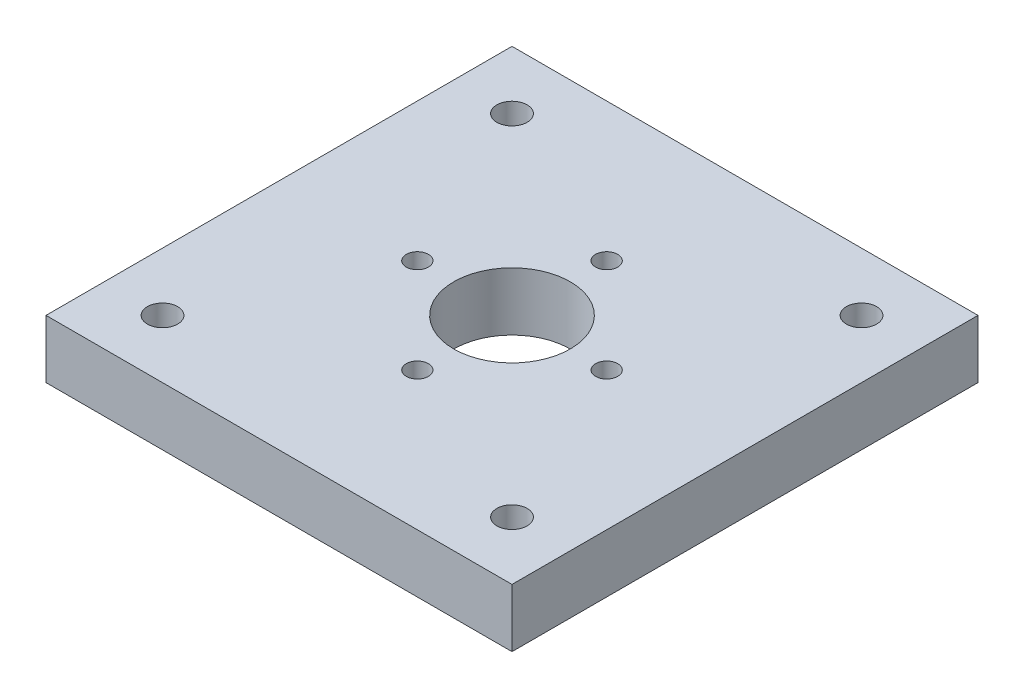
ISO-10303-21;
HEADER;
FILE_DESCRIPTION(('STEP AP214'),'2;1');
FILE_NAME('part.step','',(''),(''),'','','');
FILE_SCHEMA(('AUTOMOTIVE_DESIGN { 1 0 10303 214 1 1 1 1 }'));
ENDSEC;
DATA;
#1=APPLICATION_CONTEXT('core data for automotive mechanical design processes');
#2=APPLICATION_PROTOCOL_DEFINITION('international standard','automotive_design',2000,#1);
#3=PRODUCT_CONTEXT('',#1,'mechanical');
#4=PRODUCT('Part','Part','',(#3));
#5=PRODUCT_RELATED_PRODUCT_CATEGORY('part','',(#4));
#6=PRODUCT_DEFINITION_FORMATION('','',#4);
#7=PRODUCT_DEFINITION_CONTEXT('part definition',#1,'design');
#8=PRODUCT_DEFINITION('design','',#6,#7);
#9=PRODUCT_DEFINITION_SHAPE('','',#8);
#10=(LENGTH_UNIT() NAMED_UNIT(*) SI_UNIT(.MILLI.,.METRE.));
#11=(NAMED_UNIT(*) PLANE_ANGLE_UNIT() SI_UNIT($,.RADIAN.));
#12=(NAMED_UNIT(*) SI_UNIT($,.STERADIAN.) SOLID_ANGLE_UNIT());
#13=UNCERTAINTY_MEASURE_WITH_UNIT(LENGTH_MEASURE(1.E-05),#10,'distance_accuracy_value','');
#14=(GEOMETRIC_REPRESENTATION_CONTEXT(3) GLOBAL_UNCERTAINTY_ASSIGNED_CONTEXT((#13)) GLOBAL_UNIT_ASSIGNED_CONTEXT((#10,
#11,#12)) REPRESENTATION_CONTEXT('',''));
#15=CARTESIAN_POINT('',(0.,0.,0.));
#16=DIRECTION('',(0.,0.,1.));
#17=DIRECTION('',(1.,0.,0.));
#18=AXIS2_PLACEMENT_3D('',#15,#16,#17);
#19=CARTESIAN_POINT('',(0.,0.5,0.));
#20=DIRECTION('',(0.,1.,0.));
#21=DIRECTION('',(0.,0.,1.));
#22=AXIS2_PLACEMENT_3D('',#19,#20,#21);
#23=PLANE('',#22);
#24=CARTESIAN_POINT('',(-1.5,0.5,1.5));
#25=DIRECTION('',(0.,1.,0.));
#26=DIRECTION('',(0.,0.,1.));
#27=AXIS2_PLACEMENT_3D('',#24,#25,#26);
#28=CIRCLE('',#27,0.13);
#29=CARTESIAN_POINT('',(-1.5,0.5,1.63));
#30=VERTEX_POINT('',#29);
#31=EDGE_CURVE('E155',#30,#30,#28,.T.);
#32=ORIENTED_EDGE('',*,*,#31,.F.);
#33=EDGE_LOOP('',(#32));
#34=FACE_BOUND('',#33,.T.);
#35=CARTESIAN_POINT('',(-0.8125,0.5,0.));
#36=DIRECTION('',(0.,1.,0.));
#37=DIRECTION('',(0.,0.,1.));
#38=AXIS2_PLACEMENT_3D('',#35,#36,#37);
#39=CIRCLE('',#38,0.0950000000000084);
#40=CARTESIAN_POINT('',(-0.8125,0.5,0.0950000000000087));
#41=VERTEX_POINT('',#40);
#42=EDGE_CURVE('E143',#41,#41,#39,.T.);
#43=ORIENTED_EDGE('',*,*,#42,.F.);
#44=EDGE_LOOP('',(#43));
#45=FACE_BOUND('',#44,.T.);
#46=CARTESIAN_POINT('',(0.8125,0.5,0.));
#47=DIRECTION('',(0.,1.,0.));
#48=DIRECTION('',(0.,0.,1.));
#49=AXIS2_PLACEMENT_3D('',#46,#47,#48);
#50=CIRCLE('',#49,0.0950000000000027);
#51=CARTESIAN_POINT('',(0.8125,0.5,0.0950000000000027));
#52=VERTEX_POINT('',#51);
#53=EDGE_CURVE('E131',#52,#52,#50,.T.);
#54=ORIENTED_EDGE('',*,*,#53,.F.);
#55=EDGE_LOOP('',(#54));
#56=FACE_BOUND('',#55,.T.);
#57=CARTESIAN_POINT('',(0.,0.5,-0.8125));
#58=DIRECTION('',(0.,1.,0.));
#59=DIRECTION('',(0.,0.,1.));
#60=AXIS2_PLACEMENT_3D('',#57,#58,#59);
#61=CIRCLE('',#60,0.095);
#62=CARTESIAN_POINT('',(0.,0.5,-0.7175));
#63=VERTEX_POINT('',#62);
#64=EDGE_CURVE('E119',#63,#63,#61,.T.);
#65=ORIENTED_EDGE('',*,*,#64,.F.);
#66=EDGE_LOOP('',(#65));
#67=FACE_BOUND('',#66,.T.);
#68=DIRECTION('',(0.,0.,-1.));
#69=VECTOR('',#68,1.);
#70=CARTESIAN_POINT('',(2.,0.5,-2.));
#71=LINE('',#70,#69);
#72=CARTESIAN_POINT('',(2.,0.5,2.));
#73=VERTEX_POINT('',#72);
#74=CARTESIAN_POINT('',(2.,0.5,-2.));
#75=VERTEX_POINT('',#74);
#76=EDGE_CURVE('E89',#73,#75,#71,.T.);
#77=ORIENTED_EDGE('',*,*,#76,.T.);
#78=DIRECTION('',(-1.,0.,0.));
#79=VECTOR('',#78,1.);
#80=CARTESIAN_POINT('',(-2.,0.5,-2.));
#81=LINE('',#80,#79);
#82=CARTESIAN_POINT('',(-2.,0.5,-2.));
#83=VERTEX_POINT('',#82);
#84=EDGE_CURVE('E84',#75,#83,#81,.T.);
#85=ORIENTED_EDGE('',*,*,#84,.T.);
#86=DIRECTION('',(0.,0.,1.));
#87=VECTOR('',#86,1.);
#88=CARTESIAN_POINT('',(-2.,0.5,-2.));
#89=LINE('',#88,#87);
#90=CARTESIAN_POINT('',(-2.,0.5,2.));
#91=VERTEX_POINT('',#90);
#92=EDGE_CURVE('E87',#83,#91,#89,.T.);
#93=ORIENTED_EDGE('',*,*,#92,.T.);
#94=DIRECTION('',(1.,0.,0.));
#95=VECTOR('',#94,1.);
#96=CARTESIAN_POINT('',(-2.,0.5,2.));
#97=LINE('',#96,#95);
#98=EDGE_CURVE('E54',#91,#73,#97,.T.);
#99=ORIENTED_EDGE('',*,*,#98,.T.);
#100=EDGE_LOOP('',(#77,#85,#93,#99));
#101=FACE_BOUND('',#100,.T.);
#102=CARTESIAN_POINT('',(0.,0.5,0.));
#103=DIRECTION('',(0.,1.,0.));
#104=DIRECTION('',(0.,0.,1.));
#105=AXIS2_PLACEMENT_3D('',#102,#103,#104);
#106=CIRCLE('',#105,0.5);
#107=CARTESIAN_POINT('',(0.,0.5,0.5));
#108=VERTEX_POINT('',#107);
#109=EDGE_CURVE('E104',#108,#108,#106,.T.);
#110=ORIENTED_EDGE('',*,*,#109,.F.);
#111=EDGE_LOOP('',(#110));
#112=FACE_BOUND('',#111,.T.);
#113=CARTESIAN_POINT('',(1.5,0.5,-1.5));
#114=DIRECTION('',(0.,1.,0.));
#115=DIRECTION('',(0.,0.,1.));
#116=AXIS2_PLACEMENT_3D('',#113,#114,#115);
#117=CIRCLE('',#116,0.13);
#118=CARTESIAN_POINT('',(1.5,0.5,-1.37));
#119=VERTEX_POINT('',#118);
#120=EDGE_CURVE('E125',#119,#119,#117,.T.);
#121=ORIENTED_EDGE('',*,*,#120,.F.);
#122=EDGE_LOOP('',(#121));
#123=FACE_BOUND('',#122,.T.);
#124=CARTESIAN_POINT('',(0.,0.5,0.812499999999977));
#125=DIRECTION('',(0.,1.,0.));
#126=DIRECTION('',(0.,0.,1.));
#127=AXIS2_PLACEMENT_3D('',#124,#125,#126);
#128=CIRCLE('',#127,0.0950000000000783);
#129=CARTESIAN_POINT('',(0.,0.5,0.907500000000055));
#130=VERTEX_POINT('',#129);
#131=EDGE_CURVE('E137',#130,#130,#128,.T.);
#132=ORIENTED_EDGE('',*,*,#131,.F.);
#133=EDGE_LOOP('',(#132));
#134=FACE_BOUND('',#133,.T.);
#135=CARTESIAN_POINT('',(-1.5,0.5,-1.5));
#136=DIRECTION('',(0.,1.,0.));
#137=DIRECTION('',(0.,0.,1.));
#138=AXIS2_PLACEMENT_3D('',#135,#136,#137);
#139=CIRCLE('',#138,0.13);
#140=CARTESIAN_POINT('',(-1.5,0.5,-1.37));
#141=VERTEX_POINT('',#140);
#142=EDGE_CURVE('E149',#141,#141,#139,.T.);
#143=ORIENTED_EDGE('',*,*,#142,.F.);
#144=EDGE_LOOP('',(#143));
#145=FACE_BOUND('',#144,.T.);
#146=CARTESIAN_POINT('',(1.5,0.5,1.5));
#147=DIRECTION('',(0.,1.,0.));
#148=DIRECTION('',(0.,0.,1.));
#149=AXIS2_PLACEMENT_3D('',#146,#147,#148);
#150=CIRCLE('',#149,0.13);
#151=CARTESIAN_POINT('',(1.5,0.5,1.63));
#152=VERTEX_POINT('',#151);
#153=EDGE_CURVE('E161',#152,#152,#150,.T.);
#154=ORIENTED_EDGE('',*,*,#153,.F.);
#155=EDGE_LOOP('',(#154));
#156=FACE_BOUND('',#155,.T.);
#157=ADVANCED_FACE('F37',(#34,#45,#56,#67,#101,#112,#123,#134,#145,#156),#23,.T.);
#158=CARTESIAN_POINT('',(0.,0.,0.));
#159=DIRECTION('',(0.,1.,0.));
#160=DIRECTION('',(0.,0.,1.));
#161=AXIS2_PLACEMENT_3D('',#158,#159,#160);
#162=PLANE('',#161);
#163=DIRECTION('',(0.,0.,-1.));
#164=VECTOR('',#163,1.);
#165=CARTESIAN_POINT('',(2.,0.,-2.));
#166=LINE('',#165,#164);
#167=CARTESIAN_POINT('',(2.,0.,2.));
#168=VERTEX_POINT('',#167);
#169=CARTESIAN_POINT('',(2.,0.,-2.));
#170=VERTEX_POINT('',#169);
#171=EDGE_CURVE('E101',#168,#170,#166,.T.);
#172=ORIENTED_EDGE('',*,*,#171,.F.);
#173=DIRECTION('',(1.,0.,0.));
#174=VECTOR('',#173,1.);
#175=CARTESIAN_POINT('',(-2.,0.,2.));
#176=LINE('',#175,#174);
#177=CARTESIAN_POINT('',(-2.,0.,2.));
#178=VERTEX_POINT('',#177);
#179=EDGE_CURVE('E77',#178,#168,#176,.T.);
#180=ORIENTED_EDGE('',*,*,#179,.F.);
#181=DIRECTION('',(0.,0.,1.));
#182=VECTOR('',#181,1.);
#183=CARTESIAN_POINT('',(-2.,0.,-2.));
#184=LINE('',#183,#182);
#185=CARTESIAN_POINT('',(-2.,0.,-2.));
#186=VERTEX_POINT('',#185);
#187=EDGE_CURVE('E71',#186,#178,#184,.T.);
#188=ORIENTED_EDGE('',*,*,#187,.F.);
#189=DIRECTION('',(-1.,0.,0.));
#190=VECTOR('',#189,1.);
#191=CARTESIAN_POINT('',(-2.,0.,-2.));
#192=LINE('',#191,#190);
#193=EDGE_CURVE('E93',#170,#186,#192,.T.);
#194=ORIENTED_EDGE('',*,*,#193,.F.);
#195=EDGE_LOOP('',(#172,#180,#188,#194));
#196=FACE_BOUND('',#195,.T.);
#197=CARTESIAN_POINT('',(0.,0.,0.));
#198=DIRECTION('',(0.,1.,0.));
#199=DIRECTION('',(0.,0.,1.));
#200=AXIS2_PLACEMENT_3D('',#197,#198,#199);
#201=CIRCLE('',#200,0.5);
#202=CARTESIAN_POINT('',(0.,0.,0.5));
#203=VERTEX_POINT('',#202);
#204=EDGE_CURVE('E116',#203,#203,#201,.T.);
#205=ORIENTED_EDGE('',*,*,#204,.T.);
#206=EDGE_LOOP('',(#205));
#207=FACE_BOUND('',#206,.T.);
#208=CARTESIAN_POINT('',(0.,0.,-0.8125));
#209=DIRECTION('',(0.,1.,0.));
#210=DIRECTION('',(0.,0.,1.));
#211=AXIS2_PLACEMENT_3D('',#208,#209,#210);
#212=CIRCLE('',#211,0.095);
#213=CARTESIAN_POINT('',(0.,0.,-0.7175));
#214=VERTEX_POINT('',#213);
#215=EDGE_CURVE('E122',#214,#214,#212,.T.);
#216=ORIENTED_EDGE('',*,*,#215,.T.);
#217=EDGE_LOOP('',(#216));
#218=FACE_BOUND('',#217,.T.);
#219=CARTESIAN_POINT('',(1.5,0.,-1.5));
#220=DIRECTION('',(0.,1.,0.));
#221=DIRECTION('',(0.,0.,1.));
#222=AXIS2_PLACEMENT_3D('',#219,#220,#221);
#223=CIRCLE('',#222,0.13);
#224=CARTESIAN_POINT('',(1.5,0.,-1.37));
#225=VERTEX_POINT('',#224);
#226=EDGE_CURVE('E128',#225,#225,#223,.T.);
#227=ORIENTED_EDGE('',*,*,#226,.T.);
#228=EDGE_LOOP('',(#227));
#229=FACE_BOUND('',#228,.T.);
#230=CARTESIAN_POINT('',(0.8125,0.,0.));
#231=DIRECTION('',(0.,1.,0.));
#232=DIRECTION('',(0.,0.,1.));
#233=AXIS2_PLACEMENT_3D('',#230,#231,#232);
#234=CIRCLE('',#233,0.0950000000000027);
#235=CARTESIAN_POINT('',(0.8125,0.,0.0950000000000027));
#236=VERTEX_POINT('',#235);
#237=EDGE_CURVE('E134',#236,#236,#234,.T.);
#238=ORIENTED_EDGE('',*,*,#237,.T.);
#239=EDGE_LOOP('',(#238));
#240=FACE_BOUND('',#239,.T.);
#241=CARTESIAN_POINT('',(0.,0.,0.812499999999977));
#242=DIRECTION('',(0.,1.,0.));
#243=DIRECTION('',(0.,0.,1.));
#244=AXIS2_PLACEMENT_3D('',#241,#242,#243);
#245=CIRCLE('',#244,0.0950000000000783);
#246=CARTESIAN_POINT('',(0.,0.,0.907500000000055));
#247=VERTEX_POINT('',#246);
#248=EDGE_CURVE('E140',#247,#247,#245,.T.);
#249=ORIENTED_EDGE('',*,*,#248,.T.);
#250=EDGE_LOOP('',(#249));
#251=FACE_BOUND('',#250,.T.);
#252=CARTESIAN_POINT('',(-0.8125,0.,0.));
#253=DIRECTION('',(0.,1.,0.));
#254=DIRECTION('',(0.,0.,1.));
#255=AXIS2_PLACEMENT_3D('',#252,#253,#254);
#256=CIRCLE('',#255,0.0950000000000084);
#257=CARTESIAN_POINT('',(-0.8125,0.,0.0950000000000087));
#258=VERTEX_POINT('',#257);
#259=EDGE_CURVE('E146',#258,#258,#256,.T.);
#260=ORIENTED_EDGE('',*,*,#259,.T.);
#261=EDGE_LOOP('',(#260));
#262=FACE_BOUND('',#261,.T.);
#263=CARTESIAN_POINT('',(-1.5,0.,-1.5));
#264=DIRECTION('',(0.,1.,0.));
#265=DIRECTION('',(0.,0.,1.));
#266=AXIS2_PLACEMENT_3D('',#263,#264,#265);
#267=CIRCLE('',#266,0.13);
#268=CARTESIAN_POINT('',(-1.5,0.,-1.37));
#269=VERTEX_POINT('',#268);
#270=EDGE_CURVE('E152',#269,#269,#267,.T.);
#271=ORIENTED_EDGE('',*,*,#270,.T.);
#272=EDGE_LOOP('',(#271));
#273=FACE_BOUND('',#272,.T.);
#274=CARTESIAN_POINT('',(-1.5,0.,1.5));
#275=DIRECTION('',(0.,1.,0.));
#276=DIRECTION('',(0.,0.,1.));
#277=AXIS2_PLACEMENT_3D('',#274,#275,#276);
#278=CIRCLE('',#277,0.13);
#279=CARTESIAN_POINT('',(-1.5,0.,1.63));
#280=VERTEX_POINT('',#279);
#281=EDGE_CURVE('E158',#280,#280,#278,.T.);
#282=ORIENTED_EDGE('',*,*,#281,.T.);
#283=EDGE_LOOP('',(#282));
#284=FACE_BOUND('',#283,.T.);
#285=CARTESIAN_POINT('',(1.5,0.,1.5));
#286=DIRECTION('',(0.,1.,0.));
#287=DIRECTION('',(0.,0.,1.));
#288=AXIS2_PLACEMENT_3D('',#285,#286,#287);
#289=CIRCLE('',#288,0.13);
#290=CARTESIAN_POINT('',(1.5,0.,1.63));
#291=VERTEX_POINT('',#290);
#292=EDGE_CURVE('E164',#291,#291,#289,.T.);
#293=ORIENTED_EDGE('',*,*,#292,.T.);
#294=EDGE_LOOP('',(#293));
#295=FACE_BOUND('',#294,.T.);
#296=ADVANCED_FACE('F112',(#196,#207,#218,#229,#240,#251,#262,#273,#284,#295),#162,.F.);
#297=CARTESIAN_POINT('',(2.,0.5,-2.));
#298=DIRECTION('',(-1.,0.,0.));
#299=DIRECTION('',(0.,0.,1.));
#300=AXIS2_PLACEMENT_3D('',#297,#298,#299);
#301=PLANE('',#300);
#302=ORIENTED_EDGE('',*,*,#171,.T.);
#303=DIRECTION('',(0.,-1.,0.));
#304=VECTOR('',#303,1.);
#305=CARTESIAN_POINT('',(2.,0.5,-2.));
#306=LINE('',#305,#304);
#307=EDGE_CURVE('E11',#75,#170,#306,.T.);
#308=ORIENTED_EDGE('',*,*,#307,.F.);
#309=ORIENTED_EDGE('',*,*,#76,.F.);
#310=DIRECTION('',(0.,-1.,0.));
#311=VECTOR('',#310,1.);
#312=CARTESIAN_POINT('',(2.,0.5,2.));
#313=LINE('',#312,#311);
#314=EDGE_CURVE('E97',#73,#168,#313,.T.);
#315=ORIENTED_EDGE('',*,*,#314,.T.);
#316=EDGE_LOOP('',(#302,#308,#309,#315));
#317=FACE_BOUND('',#316,.T.);
#318=ADVANCED_FACE('F39',(#317),#301,.F.);
#319=CARTESIAN_POINT('',(-2.,0.5,-2.));
#320=DIRECTION('',(0.,0.,1.));
#321=DIRECTION('',(1.,0.,0.));
#322=AXIS2_PLACEMENT_3D('',#319,#320,#321);
#323=PLANE('',#322);
#324=ORIENTED_EDGE('',*,*,#193,.T.);
#325=DIRECTION('',(0.,-1.,0.));
#326=VECTOR('',#325,1.);
#327=CARTESIAN_POINT('',(-2.,0.5,-2.));
#328=LINE('',#327,#326);
#329=EDGE_CURVE('E46',#83,#186,#328,.T.);
#330=ORIENTED_EDGE('',*,*,#329,.F.);
#331=ORIENTED_EDGE('',*,*,#84,.F.);
#332=ORIENTED_EDGE('',*,*,#307,.T.);
#333=EDGE_LOOP('',(#324,#330,#331,#332));
#334=FACE_BOUND('',#333,.T.);
#335=ADVANCED_FACE('F92',(#334),#323,.F.);
#336=CARTESIAN_POINT('',(-2.,0.5,-2.));
#337=DIRECTION('',(1.,0.,0.));
#338=DIRECTION('',(0.,0.,-1.));
#339=AXIS2_PLACEMENT_3D('',#336,#337,#338);
#340=PLANE('',#339);
#341=ORIENTED_EDGE('',*,*,#187,.T.);
#342=DIRECTION('',(0.,-1.,0.));
#343=VECTOR('',#342,1.);
#344=CARTESIAN_POINT('',(-2.,0.5,2.));
#345=LINE('',#344,#343);
#346=EDGE_CURVE('E94',#91,#178,#345,.T.);
#347=ORIENTED_EDGE('',*,*,#346,.F.);
#348=ORIENTED_EDGE('',*,*,#92,.F.);
#349=ORIENTED_EDGE('',*,*,#329,.T.);
#350=EDGE_LOOP('',(#341,#347,#348,#349));
#351=FACE_BOUND('',#350,.T.);
#352=ADVANCED_FACE('F95',(#351),#340,.F.);
#353=CARTESIAN_POINT('',(-2.,0.5,2.));
#354=DIRECTION('',(0.,0.,-1.));
#355=DIRECTION('',(-1.,0.,0.));
#356=AXIS2_PLACEMENT_3D('',#353,#354,#355);
#357=PLANE('',#356);
#358=ORIENTED_EDGE('',*,*,#179,.T.);
#359=ORIENTED_EDGE('',*,*,#314,.F.);
#360=ORIENTED_EDGE('',*,*,#98,.F.);
#361=ORIENTED_EDGE('',*,*,#346,.T.);
#362=EDGE_LOOP('',(#358,#359,#360,#361));
#363=FACE_BOUND('',#362,.T.);
#364=ADVANCED_FACE('F109',(#363),#357,.F.);
#365=CARTESIAN_POINT('',(0.,0.5,0.));
#366=DIRECTION('',(0.,-1.,0.));
#367=DIRECTION('',(0.,0.,-1.));
#368=AXIS2_PLACEMENT_3D('',#365,#366,#367);
#369=CYLINDRICAL_SURFACE('',#368,0.5);
#370=ORIENTED_EDGE('',*,*,#109,.T.);
#371=EDGE_LOOP('',(#370));
#372=FACE_BOUND('',#371,.T.);
#373=ORIENTED_EDGE('',*,*,#204,.F.);
#374=EDGE_LOOP('',(#373));
#375=FACE_BOUND('',#374,.T.);
#376=ADVANCED_FACE('F183',(#372,#375),#369,.F.);
#377=CARTESIAN_POINT('',(0.,0.5,-0.8125));
#378=DIRECTION('',(0.,-1.,0.));
#379=DIRECTION('',(0.,0.,-1.));
#380=AXIS2_PLACEMENT_3D('',#377,#378,#379);
#381=CYLINDRICAL_SURFACE('',#380,0.095);
#382=ORIENTED_EDGE('',*,*,#64,.T.);
#383=EDGE_LOOP('',(#382));
#384=FACE_BOUND('',#383,.T.);
#385=ORIENTED_EDGE('',*,*,#215,.F.);
#386=EDGE_LOOP('',(#385));
#387=FACE_BOUND('',#386,.T.);
#388=ADVANCED_FACE('F237',(#384,#387),#381,.F.);
#389=CARTESIAN_POINT('',(1.5,0.5,-1.5));
#390=DIRECTION('',(0.,-1.,0.));
#391=DIRECTION('',(0.,0.,-1.));
#392=AXIS2_PLACEMENT_3D('',#389,#390,#391);
#393=CYLINDRICAL_SURFACE('',#392,0.13);
#394=ORIENTED_EDGE('',*,*,#120,.T.);
#395=EDGE_LOOP('',(#394));
#396=FACE_BOUND('',#395,.T.);
#397=ORIENTED_EDGE('',*,*,#226,.F.);
#398=EDGE_LOOP('',(#397));
#399=FACE_BOUND('',#398,.T.);
#400=ADVANCED_FACE('F246',(#396,#399),#393,.F.);
#401=CARTESIAN_POINT('',(0.8125,0.5,0.));
#402=DIRECTION('',(0.,-1.,0.));
#403=DIRECTION('',(0.,0.,-1.));
#404=AXIS2_PLACEMENT_3D('',#401,#402,#403);
#405=CYLINDRICAL_SURFACE('',#404,0.0950000000000027);
#406=ORIENTED_EDGE('',*,*,#53,.T.);
#407=EDGE_LOOP('',(#406));
#408=FACE_BOUND('',#407,.T.);
#409=ORIENTED_EDGE('',*,*,#237,.F.);
#410=EDGE_LOOP('',(#409));
#411=FACE_BOUND('',#410,.T.);
#412=ADVANCED_FACE('F255',(#408,#411),#405,.F.);
#413=CARTESIAN_POINT('',(0.,0.5,0.812499999999977));
#414=DIRECTION('',(0.,-1.,0.));
#415=DIRECTION('',(0.,0.,-1.));
#416=AXIS2_PLACEMENT_3D('',#413,#414,#415);
#417=CYLINDRICAL_SURFACE('',#416,0.0950000000000783);
#418=ORIENTED_EDGE('',*,*,#131,.T.);
#419=EDGE_LOOP('',(#418));
#420=FACE_BOUND('',#419,.T.);
#421=ORIENTED_EDGE('',*,*,#248,.F.);
#422=EDGE_LOOP('',(#421));
#423=FACE_BOUND('',#422,.T.);
#424=ADVANCED_FACE('F265',(#420,#423),#417,.F.);
#425=CARTESIAN_POINT('',(-0.8125,0.5,0.));
#426=DIRECTION('',(0.,-1.,0.));
#427=DIRECTION('',(0.,0.,-1.));
#428=AXIS2_PLACEMENT_3D('',#425,#426,#427);
#429=CYLINDRICAL_SURFACE('',#428,0.0950000000000084);
#430=ORIENTED_EDGE('',*,*,#42,.T.);
#431=EDGE_LOOP('',(#430));
#432=FACE_BOUND('',#431,.T.);
#433=ORIENTED_EDGE('',*,*,#259,.F.);
#434=EDGE_LOOP('',(#433));
#435=FACE_BOUND('',#434,.T.);
#436=ADVANCED_FACE('F275',(#432,#435),#429,.F.);
#437=CARTESIAN_POINT('',(-1.5,0.5,-1.5));
#438=DIRECTION('',(0.,-1.,0.));
#439=DIRECTION('',(0.,0.,-1.));
#440=AXIS2_PLACEMENT_3D('',#437,#438,#439);
#441=CYLINDRICAL_SURFACE('',#440,0.13);
#442=ORIENTED_EDGE('',*,*,#142,.T.);
#443=EDGE_LOOP('',(#442));
#444=FACE_BOUND('',#443,.T.);
#445=ORIENTED_EDGE('',*,*,#270,.F.);
#446=EDGE_LOOP('',(#445));
#447=FACE_BOUND('',#446,.T.);
#448=ADVANCED_FACE('F285',(#444,#447),#441,.F.);
#449=CARTESIAN_POINT('',(-1.5,0.5,1.5));
#450=DIRECTION('',(0.,-1.,0.));
#451=DIRECTION('',(0.,0.,-1.));
#452=AXIS2_PLACEMENT_3D('',#449,#450,#451);
#453=CYLINDRICAL_SURFACE('',#452,0.13);
#454=ORIENTED_EDGE('',*,*,#31,.T.);
#455=EDGE_LOOP('',(#454));
#456=FACE_BOUND('',#455,.T.);
#457=ORIENTED_EDGE('',*,*,#281,.F.);
#458=EDGE_LOOP('',(#457));
#459=FACE_BOUND('',#458,.T.);
#460=ADVANCED_FACE('F295',(#456,#459),#453,.F.);
#461=CARTESIAN_POINT('',(1.5,0.5,1.5));
#462=DIRECTION('',(0.,-1.,0.));
#463=DIRECTION('',(0.,0.,-1.));
#464=AXIS2_PLACEMENT_3D('',#461,#462,#463);
#465=CYLINDRICAL_SURFACE('',#464,0.13);
#466=ORIENTED_EDGE('',*,*,#153,.T.);
#467=EDGE_LOOP('',(#466));
#468=FACE_BOUND('',#467,.T.);
#469=ORIENTED_EDGE('',*,*,#292,.F.);
#470=EDGE_LOOP('',(#469));
#471=FACE_BOUND('',#470,.T.);
#472=ADVANCED_FACE('F170',(#468,#471),#465,.F.);
#473=CLOSED_SHELL('',(#157,#296,#318,#335,#352,#364,#376,#388,#400,#412,#424,#436,#448,#460,#472));
#474=MANIFOLD_SOLID_BREP('B2',#473);
#475=ADVANCED_BREP_SHAPE_REPRESENTATION('',(#18,#474),#14);
#476=SHAPE_DEFINITION_REPRESENTATION(#9,#475);
ENDSEC;
END-ISO-10303-21;
